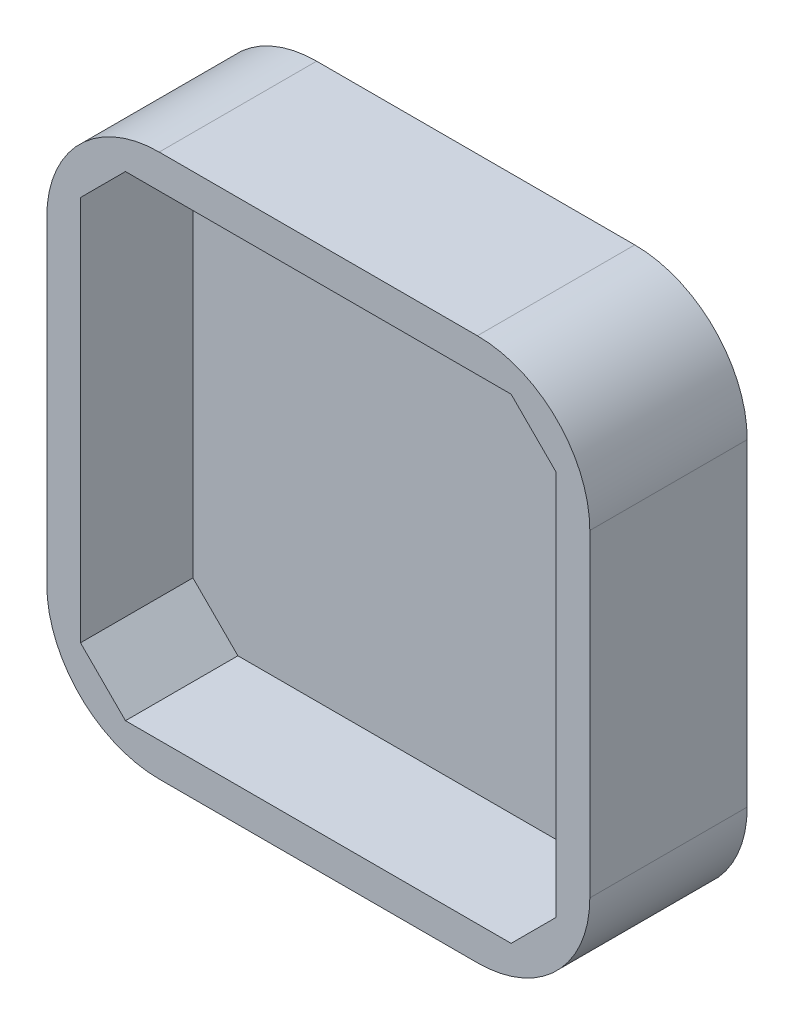
ISO-10303-21;
HEADER;
FILE_DESCRIPTION(('STEP AP214'),'2;1');
FILE_NAME('part.step','',(''),(''),'','','');
FILE_SCHEMA(('AUTOMOTIVE_DESIGN { 1 0 10303 214 1 1 1 1 }'));
ENDSEC;
DATA;
#1=APPLICATION_CONTEXT('core data for automotive mechanical design processes');
#2=APPLICATION_PROTOCOL_DEFINITION('international standard','automotive_design',2000,#1);
#3=PRODUCT_CONTEXT('',#1,'mechanical');
#4=PRODUCT('Part','Part','',(#3));
#5=PRODUCT_RELATED_PRODUCT_CATEGORY('part','',(#4));
#6=PRODUCT_DEFINITION_FORMATION('','',#4);
#7=PRODUCT_DEFINITION_CONTEXT('part definition',#1,'design');
#8=PRODUCT_DEFINITION('design','',#6,#7);
#9=PRODUCT_DEFINITION_SHAPE('','',#8);
#10=(LENGTH_UNIT() NAMED_UNIT(*) SI_UNIT(.MILLI.,.METRE.));
#11=(NAMED_UNIT(*) PLANE_ANGLE_UNIT() SI_UNIT($,.RADIAN.));
#12=(NAMED_UNIT(*) SI_UNIT($,.STERADIAN.) SOLID_ANGLE_UNIT());
#13=UNCERTAINTY_MEASURE_WITH_UNIT(LENGTH_MEASURE(1.E-05),#10,'distance_accuracy_value','');
#14=(GEOMETRIC_REPRESENTATION_CONTEXT(3) GLOBAL_UNCERTAINTY_ASSIGNED_CONTEXT((#13)) GLOBAL_UNIT_ASSIGNED_CONTEXT((#10,
#11,#12)) REPRESENTATION_CONTEXT('',''));
#15=CARTESIAN_POINT('',(0.,0.,0.));
#16=DIRECTION('',(0.,0.,1.));
#17=DIRECTION('',(1.,0.,0.));
#18=AXIS2_PLACEMENT_3D('',#15,#16,#17);
#19=CARTESIAN_POINT('',(-65.5836332326972,0.,17.6139324606775));
#20=DIRECTION('',(-1.,0.,0.));
#21=DIRECTION('',(0.,0.,1.));
#22=AXIS2_PLACEMENT_3D('',#19,#20,#21);
#23=PLANE('',#22);
#24=DIRECTION('',(0.,1.,0.));
#25=VECTOR('',#24,1.);
#26=CARTESIAN_POINT('',(-65.5836332326972,0.,17.6139324606775));
#27=LINE('',#26,#25);
#28=CARTESIAN_POINT('',(-65.5836332326972,-5.70518481580885,17.6139324606775));
#29=VERTEX_POINT('',#28);
#30=CARTESIAN_POINT('',(-65.5836332326972,22.5948151841912,17.6139324606775));
#31=VERTEX_POINT('',#30);
#32=EDGE_CURVE('E233',#29,#31,#27,.T.);
#33=ORIENTED_EDGE('',*,*,#32,.F.);
#34=DIRECTION('',(0.,0.,-1.));
#35=VECTOR('',#34,1.);
#36=CARTESIAN_POINT('',(-65.5836332326972,-5.70518481580885,17.6139324606775));
#37=LINE('',#36,#35);
#38=CARTESIAN_POINT('',(-65.5836332326972,-5.70518481580885,3.61393246067746));
#39=VERTEX_POINT('',#38);
#40=EDGE_CURVE('E11',#29,#39,#37,.T.);
#41=ORIENTED_EDGE('',*,*,#40,.T.);
#42=DIRECTION('',(0.,1.,0.));
#43=VECTOR('',#42,1.);
#44=CARTESIAN_POINT('',(-65.5836332326972,0.,3.61393246067746));
#45=LINE('',#44,#43);
#46=CARTESIAN_POINT('',(-65.5836332326972,22.5948151841912,3.61393246067746));
#47=VERTEX_POINT('',#46);
#48=EDGE_CURVE('E236',#39,#47,#45,.T.);
#49=ORIENTED_EDGE('',*,*,#48,.T.);
#50=DIRECTION('',(0.,0.,-1.));
#51=VECTOR('',#50,1.);
#52=CARTESIAN_POINT('',(-65.5836332326972,22.5948151841912,17.6139324606775));
#53=LINE('',#52,#51);
#54=EDGE_CURVE('E44',#47,#31,#53,.F.);
#55=ORIENTED_EDGE('',*,*,#54,.T.);
#56=EDGE_LOOP('',(#33,#41,#49,#55));
#57=FACE_BOUND('',#56,.T.);
#58=ADVANCED_FACE('F36',(#57),#23,.F.);
#59=CARTESIAN_POINT('',(0.,32.5948151841912,17.6139324606775));
#60=DIRECTION('',(0.,1.,0.));
#61=DIRECTION('',(0.,0.,1.));
#62=AXIS2_PLACEMENT_3D('',#59,#60,#61);
#63=PLANE('',#62);
#64=DIRECTION('',(1.,0.,0.));
#65=VECTOR('',#64,1.);
#66=CARTESIAN_POINT('',(0.,32.5948151841912,3.61393246067746));
#67=LINE('',#66,#65);
#68=CARTESIAN_POINT('',(-103.883633232697,32.5948151841912,3.61393246067746));
#69=VERTEX_POINT('',#68);
#70=CARTESIAN_POINT('',(-75.5836332326972,32.5948151841912,3.61393246067746));
#71=VERTEX_POINT('',#70);
#72=EDGE_CURVE('E164',#69,#71,#67,.T.);
#73=ORIENTED_EDGE('',*,*,#72,.F.);
#74=DIRECTION('',(0.,0.,-1.));
#75=VECTOR('',#74,1.);
#76=CARTESIAN_POINT('',(-103.883633232697,32.5948151841912,17.6139324606775));
#77=LINE('',#76,#75);
#78=CARTESIAN_POINT('',(-103.883633232697,32.5948151841912,17.6139324606775));
#79=VERTEX_POINT('',#78);
#80=EDGE_CURVE('E216',#69,#79,#77,.F.);
#81=ORIENTED_EDGE('',*,*,#80,.T.);
#82=DIRECTION('',(1.,0.,0.));
#83=VECTOR('',#82,1.);
#84=CARTESIAN_POINT('',(0.,32.5948151841912,17.6139324606775));
#85=LINE('',#84,#83);
#86=CARTESIAN_POINT('',(-75.5836332326972,32.5948151841912,17.6139324606775));
#87=VERTEX_POINT('',#86);
#88=EDGE_CURVE('E200',#79,#87,#85,.T.);
#89=ORIENTED_EDGE('',*,*,#88,.T.);
#90=DIRECTION('',(0.,0.,-1.));
#91=VECTOR('',#90,1.);
#92=CARTESIAN_POINT('',(-75.5836332326972,32.5948151841912,3.61393246067746));
#93=LINE('',#92,#91);
#94=EDGE_CURVE('E213',#87,#71,#93,.T.);
#95=ORIENTED_EDGE('',*,*,#94,.T.);
#96=EDGE_LOOP('',(#73,#81,#89,#95));
#97=FACE_BOUND('',#96,.T.);
#98=ADVANCED_FACE('F249',(#97),#63,.T.);
#99=CARTESIAN_POINT('',(-113.883633232697,0.,17.6139324606775));
#100=DIRECTION('',(-1.,0.,0.));
#101=DIRECTION('',(0.,0.,1.));
#102=AXIS2_PLACEMENT_3D('',#99,#100,#101);
#103=PLANE('',#102);
#104=DIRECTION('',(0.,1.,0.));
#105=VECTOR('',#104,1.);
#106=CARTESIAN_POINT('',(-113.883633232697,0.,17.6139324606775));
#107=LINE('',#106,#105);
#108=CARTESIAN_POINT('',(-113.883633232697,-5.70518481580885,17.6139324606775));
#109=VERTEX_POINT('',#108);
#110=CARTESIAN_POINT('',(-113.883633232697,22.5948151841912,17.6139324606775));
#111=VERTEX_POINT('',#110);
#112=EDGE_CURVE('E277',#109,#111,#107,.T.);
#113=ORIENTED_EDGE('',*,*,#112,.T.);
#114=DIRECTION('',(0.,0.,-1.));
#115=VECTOR('',#114,1.);
#116=CARTESIAN_POINT('',(-113.883633232697,22.5948151841912,17.6139324606775));
#117=LINE('',#116,#115);
#118=CARTESIAN_POINT('',(-113.883633232697,22.5948151841912,3.61393246067746));
#119=VERTEX_POINT('',#118);
#120=EDGE_CURVE('E202',#111,#119,#117,.T.);
#121=ORIENTED_EDGE('',*,*,#120,.T.);
#122=DIRECTION('',(0.,1.,0.));
#123=VECTOR('',#122,1.);
#124=CARTESIAN_POINT('',(-113.883633232697,0.,3.61393246067746));
#125=LINE('',#124,#123);
#126=CARTESIAN_POINT('',(-113.883633232697,-5.70518481580885,3.61393246067746));
#127=VERTEX_POINT('',#126);
#128=EDGE_CURVE('E254',#127,#119,#125,.T.);
#129=ORIENTED_EDGE('',*,*,#128,.F.);
#130=DIRECTION('',(0.,0.,-1.));
#131=VECTOR('',#130,1.);
#132=CARTESIAN_POINT('',(-113.883633232697,-5.70518481580885,17.6139324606775));
#133=LINE('',#132,#131);
#134=EDGE_CURVE('E173',#127,#109,#133,.F.);
#135=ORIENTED_EDGE('',*,*,#134,.T.);
#136=EDGE_LOOP('',(#113,#121,#129,#135));
#137=FACE_BOUND('',#136,.T.);
#138=ADVANCED_FACE('F327',(#137),#103,.T.);
#139=CARTESIAN_POINT('',(-21.494409024253,-21.494409024253,17.6139324606775));
#140=DIRECTION('',(0.707106781186547,0.707106781186548,0.));
#141=DIRECTION('',(-0.707106781186548,0.707106781186547,0.));
#142=AXIS2_PLACEMENT_3D('',#139,#140,#141);
#143=PLANE('',#142);
#144=DIRECTION('',(0.707106781186548,-0.707106781186547,0.));
#145=VECTOR('',#144,1.);
#146=CARTESIAN_POINT('',(-21.494409024253,-21.494409024253,7.61393246067746));
#147=LINE('',#146,#145);
#148=CARTESIAN_POINT('',(-72.5836332326972,29.5948151841912,7.61393246067746));
#149=VERTEX_POINT('',#148);
#150=CARTESIAN_POINT('',(-68.5836332326972,25.5948151841912,7.61393246067746));
#151=VERTEX_POINT('',#150);
#152=EDGE_CURVE('E152',#149,#151,#147,.T.);
#153=ORIENTED_EDGE('',*,*,#152,.T.);
#154=DIRECTION('',(0.,0.,-1.));
#155=VECTOR('',#154,1.);
#156=CARTESIAN_POINT('',(-68.5836332326972,25.5948151841912,17.6139324606775));
#157=LINE('',#156,#155);
#158=CARTESIAN_POINT('',(-68.5836332326972,25.5948151841912,17.6139324606775));
#159=VERTEX_POINT('',#158);
#160=EDGE_CURVE('E156',#159,#151,#157,.T.);
#161=ORIENTED_EDGE('',*,*,#160,.F.);
#162=DIRECTION('',(0.707106781186548,-0.707106781186547,0.));
#163=VECTOR('',#162,1.);
#164=CARTESIAN_POINT('',(-21.494409024253,-21.494409024253,17.6139324606775));
#165=LINE('',#164,#163);
#166=CARTESIAN_POINT('',(-72.5836332326972,29.5948151841912,17.6139324606775));
#167=VERTEX_POINT('',#166);
#168=EDGE_CURVE('E180',#167,#159,#165,.T.);
#169=ORIENTED_EDGE('',*,*,#168,.F.);
#170=DIRECTION('',(0.,0.,-1.));
#171=VECTOR('',#170,1.);
#172=CARTESIAN_POINT('',(-72.5836332326972,29.5948151841912,17.6139324606775));
#173=LINE('',#172,#171);
#174=EDGE_CURVE('E159',#167,#149,#173,.T.);
#175=ORIENTED_EDGE('',*,*,#174,.T.);
#176=EDGE_LOOP('',(#153,#161,#169,#175));
#177=FACE_BOUND('',#176,.T.);
#178=ADVANCED_FACE('F154',(#177),#143,.F.);
#179=CARTESIAN_POINT('',(-68.5836332326972,0.,17.6139324606775));
#180=DIRECTION('',(-1.,0.,0.));
#181=DIRECTION('',(0.,0.,1.));
#182=AXIS2_PLACEMENT_3D('',#179,#180,#181);
#183=PLANE('',#182);
#184=DIRECTION('',(0.,1.,0.));
#185=VECTOR('',#184,1.);
#186=CARTESIAN_POINT('',(-68.5836332326972,0.,7.61393246067746));
#187=LINE('',#186,#185);
#188=CARTESIAN_POINT('',(-68.5836332326972,-8.70518481580885,7.61393246067746));
#189=VERTEX_POINT('',#188);
#190=EDGE_CURVE('E169',#189,#151,#187,.T.);
#191=ORIENTED_EDGE('',*,*,#190,.F.);
#192=DIRECTION('',(0.,0.,-1.));
#193=VECTOR('',#192,1.);
#194=CARTESIAN_POINT('',(-68.5836332326972,-8.70518481580885,17.6139324606775));
#195=LINE('',#194,#193);
#196=CARTESIAN_POINT('',(-68.5836332326972,-8.70518481580885,17.6139324606775));
#197=VERTEX_POINT('',#196);
#198=EDGE_CURVE('E174',#197,#189,#195,.T.);
#199=ORIENTED_EDGE('',*,*,#198,.F.);
#200=DIRECTION('',(0.,1.,0.));
#201=VECTOR('',#200,1.);
#202=CARTESIAN_POINT('',(-68.5836332326972,0.,17.6139324606775));
#203=LINE('',#202,#201);
#204=EDGE_CURVE('E172',#197,#159,#203,.T.);
#205=ORIENTED_EDGE('',*,*,#204,.T.);
#206=ORIENTED_EDGE('',*,*,#160,.T.);
#207=EDGE_LOOP('',(#191,#199,#205,#206));
#208=FACE_BOUND('',#207,.T.);
#209=ADVANCED_FACE('F168',(#208),#183,.T.);
#210=CARTESIAN_POINT('',(-29.9392242084443,29.9392242084442,17.6139324606775));
#211=DIRECTION('',(-0.707106781186548,0.707106781186547,0.));
#212=DIRECTION('',(-0.707106781186547,-0.707106781186548,0.));
#213=AXIS2_PLACEMENT_3D('',#210,#211,#212);
#214=PLANE('',#213);
#215=DIRECTION('',(0.707106781186547,0.707106781186548,0.));
#216=VECTOR('',#215,1.);
#217=CARTESIAN_POINT('',(-29.9392242084443,29.9392242084442,7.61393246067746));
#218=LINE('',#217,#216);
#219=CARTESIAN_POINT('',(-72.5836332326972,-12.7051848158088,7.61393246067746));
#220=VERTEX_POINT('',#219);
#221=EDGE_CURVE('E179',#220,#189,#218,.T.);
#222=ORIENTED_EDGE('',*,*,#221,.F.);
#223=DIRECTION('',(0.,0.,-1.));
#224=VECTOR('',#223,1.);
#225=CARTESIAN_POINT('',(-72.5836332326972,-12.7051848158088,17.6139324606775));
#226=LINE('',#225,#224);
#227=CARTESIAN_POINT('',(-72.5836332326972,-12.7051848158088,17.6139324606775));
#228=VERTEX_POINT('',#227);
#229=EDGE_CURVE('E189',#228,#220,#226,.T.);
#230=ORIENTED_EDGE('',*,*,#229,.F.);
#231=DIRECTION('',(0.707106781186547,0.707106781186548,0.));
#232=VECTOR('',#231,1.);
#233=CARTESIAN_POINT('',(-29.9392242084443,29.9392242084442,17.6139324606775));
#234=LINE('',#233,#232);
#235=EDGE_CURVE('E272',#228,#197,#234,.T.);
#236=ORIENTED_EDGE('',*,*,#235,.T.);
#237=ORIENTED_EDGE('',*,*,#198,.T.);
#238=EDGE_LOOP('',(#222,#230,#236,#237));
#239=FACE_BOUND('',#238,.T.);
#240=ADVANCED_FACE('F298',(#239),#214,.T.);
#241=CARTESIAN_POINT('',(0.,-12.7051848158088,17.6139324606775));
#242=DIRECTION('',(0.,1.,0.));
#243=DIRECTION('',(-1.,0.,0.));
#244=AXIS2_PLACEMENT_3D('',#241,#242,#243);
#245=PLANE('',#244);
#246=DIRECTION('',(1.,0.,0.));
#247=VECTOR('',#246,1.);
#248=CARTESIAN_POINT('',(0.,-12.7051848158088,7.61393246067746));
#249=LINE('',#248,#247);
#250=CARTESIAN_POINT('',(-106.883633232697,-12.7051848158089,7.61393246067746));
#251=VERTEX_POINT('',#250);
#252=EDGE_CURVE('E184',#251,#220,#249,.T.);
#253=ORIENTED_EDGE('',*,*,#252,.F.);
#254=DIRECTION('',(0.,0.,-1.));
#255=VECTOR('',#254,1.);
#256=CARTESIAN_POINT('',(-106.883633232697,-12.7051848158089,17.6139324606775));
#257=LINE('',#256,#255);
#258=CARTESIAN_POINT('',(-106.883633232697,-12.7051848158089,17.6139324606775));
#259=VERTEX_POINT('',#258);
#260=EDGE_CURVE('E191',#259,#251,#257,.T.);
#261=ORIENTED_EDGE('',*,*,#260,.F.);
#262=DIRECTION('',(1.,0.,0.));
#263=VECTOR('',#262,1.);
#264=CARTESIAN_POINT('',(0.,-12.7051848158088,17.6139324606775));
#265=LINE('',#264,#263);
#266=EDGE_CURVE('E269',#259,#228,#265,.T.);
#267=ORIENTED_EDGE('',*,*,#266,.T.);
#268=ORIENTED_EDGE('',*,*,#229,.T.);
#269=EDGE_LOOP('',(#253,#261,#267,#268));
#270=FACE_BOUND('',#269,.T.);
#271=ADVANCED_FACE('F294',(#270),#245,.T.);
#272=CARTESIAN_POINT('',(-59.7944090242532,-59.794409024253,17.6139324606775));
#273=DIRECTION('',(0.707106781186548,0.707106781186547,0.));
#274=DIRECTION('',(-0.707106781186547,0.707106781186548,0.));
#275=AXIS2_PLACEMENT_3D('',#272,#273,#274);
#276=PLANE('',#275);
#277=DIRECTION('',(0.707106781186547,-0.707106781186548,0.));
#278=VECTOR('',#277,1.);
#279=CARTESIAN_POINT('',(-59.7944090242532,-59.794409024253,7.61393246067746));
#280=LINE('',#279,#278);
#281=CARTESIAN_POINT('',(-110.883633232697,-8.70518481580885,7.61393246067746));
#282=VERTEX_POINT('',#281);
#283=EDGE_CURVE('E288',#282,#251,#280,.T.);
#284=ORIENTED_EDGE('',*,*,#283,.F.);
#285=DIRECTION('',(0.,0.,-1.));
#286=VECTOR('',#285,1.);
#287=CARTESIAN_POINT('',(-110.883633232697,-8.70518481580885,17.6139324606775));
#288=LINE('',#287,#286);
#289=CARTESIAN_POINT('',(-110.883633232697,-8.70518481580885,17.6139324606775));
#290=VERTEX_POINT('',#289);
#291=EDGE_CURVE('E193',#290,#282,#288,.T.);
#292=ORIENTED_EDGE('',*,*,#291,.F.);
#293=DIRECTION('',(0.707106781186547,-0.707106781186548,0.));
#294=VECTOR('',#293,1.);
#295=CARTESIAN_POINT('',(-59.7944090242532,-59.794409024253,17.6139324606775));
#296=LINE('',#295,#294);
#297=EDGE_CURVE('E266',#290,#259,#296,.T.);
#298=ORIENTED_EDGE('',*,*,#297,.T.);
#299=ORIENTED_EDGE('',*,*,#260,.T.);
#300=EDGE_LOOP('',(#284,#292,#298,#299));
#301=FACE_BOUND('',#300,.T.);
#302=ADVANCED_FACE('F313',(#301),#276,.T.);
#303=CARTESIAN_POINT('',(-110.883633232697,0.,17.6139324606775));
#304=DIRECTION('',(-1.,0.,0.));
#305=DIRECTION('',(0.,-1.,0.));
#306=AXIS2_PLACEMENT_3D('',#303,#304,#305);
#307=PLANE('',#306);
#308=DIRECTION('',(0.,1.,0.));
#309=VECTOR('',#308,1.);
#310=CARTESIAN_POINT('',(-110.883633232697,0.,7.61393246067746));
#311=LINE('',#310,#309);
#312=CARTESIAN_POINT('',(-110.883633232697,25.5948151841912,7.61393246067746));
#313=VERTEX_POINT('',#312);
#314=EDGE_CURVE('E285',#282,#313,#311,.T.);
#315=ORIENTED_EDGE('',*,*,#314,.T.);
#316=DIRECTION('',(0.,0.,-1.));
#317=VECTOR('',#316,1.);
#318=CARTESIAN_POINT('',(-110.883633232697,25.5948151841912,17.6139324606775));
#319=LINE('',#318,#317);
#320=CARTESIAN_POINT('',(-110.883633232697,25.5948151841912,17.6139324606775));
#321=VERTEX_POINT('',#320);
#322=EDGE_CURVE('E195',#321,#313,#319,.T.);
#323=ORIENTED_EDGE('',*,*,#322,.F.);
#324=DIRECTION('',(0.,1.,0.));
#325=VECTOR('',#324,1.);
#326=CARTESIAN_POINT('',(-110.883633232697,0.,17.6139324606775));
#327=LINE('',#326,#325);
#328=EDGE_CURVE('E264',#290,#321,#327,.T.);
#329=ORIENTED_EDGE('',*,*,#328,.F.);
#330=ORIENTED_EDGE('',*,*,#291,.T.);
#331=EDGE_LOOP('',(#315,#323,#329,#330));
#332=FACE_BOUND('',#331,.T.);
#333=ADVANCED_FACE('F310',(#332),#307,.F.);
#334=CARTESIAN_POINT('',(-68.2392242084442,68.2392242084442,17.6139324606775));
#335=DIRECTION('',(0.707106781186547,-0.707106781186548,0.));
#336=DIRECTION('',(0.707106781186548,0.707106781186547,0.));
#337=AXIS2_PLACEMENT_3D('',#334,#335,#336);
#338=PLANE('',#337);
#339=DIRECTION('',(-0.707106781186548,-0.707106781186547,0.));
#340=VECTOR('',#339,1.);
#341=CARTESIAN_POINT('',(-68.2392242084442,68.2392242084442,7.61393246067746));
#342=LINE('',#341,#340);
#343=CARTESIAN_POINT('',(-106.883633232697,29.5948151841912,7.61393246067746));
#344=VERTEX_POINT('',#343);
#345=EDGE_CURVE('E282',#344,#313,#342,.T.);
#346=ORIENTED_EDGE('',*,*,#345,.F.);
#347=DIRECTION('',(0.,0.,-1.));
#348=VECTOR('',#347,1.);
#349=CARTESIAN_POINT('',(-106.883633232697,29.5948151841912,17.6139324606775));
#350=LINE('',#349,#348);
#351=CARTESIAN_POINT('',(-106.883633232697,29.5948151841912,17.6139324606775));
#352=VERTEX_POINT('',#351);
#353=EDGE_CURVE('E197',#352,#344,#350,.T.);
#354=ORIENTED_EDGE('',*,*,#353,.F.);
#355=DIRECTION('',(-0.707106781186548,-0.707106781186547,0.));
#356=VECTOR('',#355,1.);
#357=CARTESIAN_POINT('',(-68.2392242084442,68.2392242084442,17.6139324606775));
#358=LINE('',#357,#356);
#359=EDGE_CURVE('E261',#352,#321,#358,.T.);
#360=ORIENTED_EDGE('',*,*,#359,.T.);
#361=ORIENTED_EDGE('',*,*,#322,.T.);
#362=EDGE_LOOP('',(#346,#354,#360,#361));
#363=FACE_BOUND('',#362,.T.);
#364=ADVANCED_FACE('F306',(#363),#338,.T.);
#365=CARTESIAN_POINT('',(0.,29.5948151841912,17.6139324606775));
#366=DIRECTION('',(0.,1.,0.));
#367=DIRECTION('',(0.,0.,1.));
#368=AXIS2_PLACEMENT_3D('',#365,#366,#367);
#369=PLANE('',#368);
#370=DIRECTION('',(1.,0.,0.));
#371=VECTOR('',#370,1.);
#372=CARTESIAN_POINT('',(0.,29.5948151841912,7.61393246067746));
#373=LINE('',#372,#371);
#374=EDGE_CURVE('E163',#344,#149,#373,.T.);
#375=ORIENTED_EDGE('',*,*,#374,.T.);
#376=ORIENTED_EDGE('',*,*,#174,.F.);
#377=DIRECTION('',(1.,0.,0.));
#378=VECTOR('',#377,1.);
#379=CARTESIAN_POINT('',(0.,29.5948151841912,17.6139324606775));
#380=LINE('',#379,#378);
#381=EDGE_CURVE('E182',#352,#167,#380,.T.);
#382=ORIENTED_EDGE('',*,*,#381,.F.);
#383=ORIENTED_EDGE('',*,*,#353,.T.);
#384=EDGE_LOOP('',(#375,#376,#382,#383));
#385=FACE_BOUND('',#384,.T.);
#386=ADVANCED_FACE('F303',(#385),#369,.F.);
#387=CARTESIAN_POINT('',(0.,-15.7051848158089,17.6139324606775));
#388=DIRECTION('',(0.,1.,0.));
#389=DIRECTION('',(0.,0.,1.));
#390=AXIS2_PLACEMENT_3D('',#387,#388,#389);
#391=PLANE('',#390);
#392=DIRECTION('',(1.,0.,0.));
#393=VECTOR('',#392,1.);
#394=CARTESIAN_POINT('',(0.,-15.7051848158089,17.6139324606775));
#395=LINE('',#394,#393);
#396=CARTESIAN_POINT('',(-103.883633232697,-15.7051848158089,17.6139324606775));
#397=VERTEX_POINT('',#396);
#398=CARTESIAN_POINT('',(-75.5836332326972,-15.7051848158089,17.6139324606775));
#399=VERTEX_POINT('',#398);
#400=EDGE_CURVE('E243',#397,#399,#395,.T.);
#401=ORIENTED_EDGE('',*,*,#400,.F.);
#402=DIRECTION('',(0.,0.,-1.));
#403=VECTOR('',#402,1.);
#404=CARTESIAN_POINT('',(-103.883633232697,-15.7051848158089,3.61393246067746));
#405=LINE('',#404,#403);
#406=CARTESIAN_POINT('',(-103.883633232697,-15.7051848158089,3.61393246067746));
#407=VERTEX_POINT('',#406);
#408=EDGE_CURVE('E226',#397,#407,#405,.T.);
#409=ORIENTED_EDGE('',*,*,#408,.T.);
#410=DIRECTION('',(1.,0.,0.));
#411=VECTOR('',#410,1.);
#412=CARTESIAN_POINT('',(0.,-15.7051848158089,3.61393246067746));
#413=LINE('',#412,#411);
#414=CARTESIAN_POINT('',(-75.5836332326972,-15.7051848158089,3.61393246067746));
#415=VERTEX_POINT('',#414);
#416=EDGE_CURVE('E256',#407,#415,#413,.T.);
#417=ORIENTED_EDGE('',*,*,#416,.T.);
#418=DIRECTION('',(0.,0.,-1.));
#419=VECTOR('',#418,1.);
#420=CARTESIAN_POINT('',(-75.5836332326972,-15.7051848158089,17.6139324606775));
#421=LINE('',#420,#419);
#422=EDGE_CURVE('E51',#415,#399,#421,.F.);
#423=ORIENTED_EDGE('',*,*,#422,.T.);
#424=EDGE_LOOP('',(#401,#409,#417,#423));
#425=FACE_BOUND('',#424,.T.);
#426=ADVANCED_FACE('F331',(#425),#391,.F.);
#427=CARTESIAN_POINT('',(0.,0.,17.6139324606775));
#428=DIRECTION('',(0.,0.,-1.));
#429=DIRECTION('',(-1.,0.,0.));
#430=AXIS2_PLACEMENT_3D('',#427,#428,#429);
#431=PLANE('',#430);
#432=ORIENTED_EDGE('',*,*,#168,.T.);
#433=ORIENTED_EDGE('',*,*,#204,.F.);
#434=ORIENTED_EDGE('',*,*,#235,.F.);
#435=ORIENTED_EDGE('',*,*,#266,.F.);
#436=ORIENTED_EDGE('',*,*,#297,.F.);
#437=ORIENTED_EDGE('',*,*,#328,.T.);
#438=ORIENTED_EDGE('',*,*,#359,.F.);
#439=ORIENTED_EDGE('',*,*,#381,.T.);
#440=EDGE_LOOP('',(#432,#433,#434,#435,#436,#437,#438,#439));
#441=FACE_BOUND('',#440,.T.);
#442=ORIENTED_EDGE('',*,*,#88,.F.);
#443=CARTESIAN_POINT('',(-103.883633232697,22.5948151841912,17.6139324606775));
#444=DIRECTION('',(0.,0.,-1.));
#445=DIRECTION('',(-1.,0.,0.));
#446=AXIS2_PLACEMENT_3D('',#443,#444,#445);
#447=CIRCLE('',#446,10.);
#448=EDGE_CURVE('E223',#79,#111,#447,.F.);
#449=ORIENTED_EDGE('',*,*,#448,.T.);
#450=ORIENTED_EDGE('',*,*,#112,.F.);
#451=CARTESIAN_POINT('',(-103.883633232697,-5.70518481580885,17.6139324606775));
#452=DIRECTION('',(0.,0.,-1.));
#453=DIRECTION('',(-1.,0.,0.));
#454=AXIS2_PLACEMENT_3D('',#451,#452,#453);
#455=CIRCLE('',#454,10.);
#456=EDGE_CURVE('E58',#109,#397,#455,.F.);
#457=ORIENTED_EDGE('',*,*,#456,.T.);
#458=ORIENTED_EDGE('',*,*,#400,.T.);
#459=CARTESIAN_POINT('',(-75.5836332326972,-5.70518481580885,17.6139324606775));
#460=DIRECTION('',(0.,0.,-1.));
#461=DIRECTION('',(-1.,0.,0.));
#462=AXIS2_PLACEMENT_3D('',#459,#460,#461);
#463=CIRCLE('',#462,10.);
#464=EDGE_CURVE('E220',#399,#29,#463,.F.);
#465=ORIENTED_EDGE('',*,*,#464,.T.);
#466=ORIENTED_EDGE('',*,*,#32,.T.);
#467=CARTESIAN_POINT('',(-75.5836332326972,22.5948151841912,17.6139324606775));
#468=DIRECTION('',(0.,0.,-1.));
#469=DIRECTION('',(-1.,0.,0.));
#470=AXIS2_PLACEMENT_3D('',#467,#468,#469);
#471=CIRCLE('',#470,10.);
#472=EDGE_CURVE('E218',#31,#87,#471,.F.);
#473=ORIENTED_EDGE('',*,*,#472,.T.);
#474=EDGE_LOOP('',(#442,#449,#450,#457,#458,#465,#466,#473));
#475=FACE_BOUND('',#474,.T.);
#476=ADVANCED_FACE('F240',(#441,#475),#431,.F.);
#477=CARTESIAN_POINT('',(0.,0.,7.61393246067746));
#478=DIRECTION('',(0.,0.,-1.));
#479=DIRECTION('',(-1.,0.,0.));
#480=AXIS2_PLACEMENT_3D('',#477,#478,#479);
#481=PLANE('',#480);
#482=ORIENTED_EDGE('',*,*,#152,.F.);
#483=ORIENTED_EDGE('',*,*,#374,.F.);
#484=ORIENTED_EDGE('',*,*,#345,.T.);
#485=ORIENTED_EDGE('',*,*,#314,.F.);
#486=ORIENTED_EDGE('',*,*,#283,.T.);
#487=ORIENTED_EDGE('',*,*,#252,.T.);
#488=ORIENTED_EDGE('',*,*,#221,.T.);
#489=ORIENTED_EDGE('',*,*,#190,.T.);
#490=EDGE_LOOP('',(#482,#483,#484,#485,#486,#487,#488,#489));
#491=FACE_BOUND('',#490,.T.);
#492=ADVANCED_FACE('F176',(#491),#481,.F.);
#493=CARTESIAN_POINT('',(0.,0.,3.61393246067746));
#494=DIRECTION('',(0.,0.,-1.));
#495=DIRECTION('',(-1.,0.,0.));
#496=AXIS2_PLACEMENT_3D('',#493,#494,#495);
#497=PLANE('',#496);
#498=CARTESIAN_POINT('',(-74.2336332326972,23.9448151841912,3.61393246067746));
#499=DIRECTION('',(0.,0.,-1.));
#500=DIRECTION('',(-1.,0.,0.));
#501=AXIS2_PLACEMENT_3D('',#498,#499,#500);
#502=CIRCLE('',#501,1.5);
#503=CARTESIAN_POINT('',(-75.7336332326972,23.9448151841912,3.61393246067746));
#504=VERTEX_POINT('',#503);
#505=EDGE_CURVE('E574',#504,#504,#502,.T.);
#506=ORIENTED_EDGE('',*,*,#505,.F.);
#507=EDGE_LOOP('',(#506));
#508=FACE_BOUND('',#507,.T.);
#509=CARTESIAN_POINT('',(-74.2336332326981,-7.05518481580885,3.61393246067746));
#510=DIRECTION('',(0.,0.,-1.));
#511=DIRECTION('',(-1.,0.,0.));
#512=AXIS2_PLACEMENT_3D('',#509,#510,#511);
#513=CIRCLE('',#512,1.5);
#514=CARTESIAN_POINT('',(-75.7336332326981,-7.05518481580885,3.61393246067746));
#515=VERTEX_POINT('',#514);
#516=EDGE_CURVE('E580',#515,#515,#513,.T.);
#517=ORIENTED_EDGE('',*,*,#516,.F.);
#518=EDGE_LOOP('',(#517));
#519=FACE_BOUND('',#518,.T.);
#520=CARTESIAN_POINT('',(-105.233633232698,-7.05518481580797,3.61393246067746));
#521=DIRECTION('',(0.,0.,-1.));
#522=DIRECTION('',(-1.,0.,0.));
#523=AXIS2_PLACEMENT_3D('',#520,#521,#522);
#524=CIRCLE('',#523,1.5);
#525=CARTESIAN_POINT('',(-106.733633232698,-7.05518481580797,3.61393246067746));
#526=VERTEX_POINT('',#525);
#527=EDGE_CURVE('E586',#526,#526,#524,.T.);
#528=ORIENTED_EDGE('',*,*,#527,.F.);
#529=EDGE_LOOP('',(#528));
#530=FACE_BOUND('',#529,.T.);
#531=CARTESIAN_POINT('',(-105.233633232697,23.944815184192,3.61393246067746));
#532=DIRECTION('',(0.,0.,-1.));
#533=DIRECTION('',(-1.,0.,0.));
#534=AXIS2_PLACEMENT_3D('',#531,#532,#533);
#535=CIRCLE('',#534,1.5);
#536=CARTESIAN_POINT('',(-106.733633232697,23.944815184192,3.61393246067746));
#537=VERTEX_POINT('',#536);
#538=EDGE_CURVE('E568',#537,#537,#535,.T.);
#539=ORIENTED_EDGE('',*,*,#538,.F.);
#540=EDGE_LOOP('',(#539));
#541=FACE_BOUND('',#540,.T.);
#542=ORIENTED_EDGE('',*,*,#128,.T.);
#543=CARTESIAN_POINT('',(-103.883633232697,22.5948151841912,3.61393246067746));
#544=DIRECTION('',(0.,0.,-1.));
#545=DIRECTION('',(-1.,0.,0.));
#546=AXIS2_PLACEMENT_3D('',#543,#544,#545);
#547=CIRCLE('',#546,10.);
#548=EDGE_CURVE('E211',#119,#69,#547,.T.);
#549=ORIENTED_EDGE('',*,*,#548,.T.);
#550=ORIENTED_EDGE('',*,*,#72,.T.);
#551=CARTESIAN_POINT('',(-75.5836332326972,22.5948151841912,3.61393246067746));
#552=DIRECTION('',(0.,0.,-1.));
#553=DIRECTION('',(-1.,0.,0.));
#554=AXIS2_PLACEMENT_3D('',#551,#552,#553);
#555=CIRCLE('',#554,10.);
#556=EDGE_CURVE('E205',#71,#47,#555,.T.);
#557=ORIENTED_EDGE('',*,*,#556,.T.);
#558=ORIENTED_EDGE('',*,*,#48,.F.);
#559=CARTESIAN_POINT('',(-75.5836332326972,-5.70518481580885,3.61393246067746));
#560=DIRECTION('',(0.,0.,-1.));
#561=DIRECTION('',(-1.,0.,0.));
#562=AXIS2_PLACEMENT_3D('',#559,#560,#561);
#563=CIRCLE('',#562,10.);
#564=EDGE_CURVE('E207',#39,#415,#563,.T.);
#565=ORIENTED_EDGE('',*,*,#564,.T.);
#566=ORIENTED_EDGE('',*,*,#416,.F.);
#567=CARTESIAN_POINT('',(-103.883633232697,-5.70518481580885,3.61393246067746));
#568=DIRECTION('',(0.,0.,-1.));
#569=DIRECTION('',(-1.,0.,0.));
#570=AXIS2_PLACEMENT_3D('',#567,#568,#569);
#571=CIRCLE('',#570,10.);
#572=EDGE_CURVE('E209',#407,#127,#571,.T.);
#573=ORIENTED_EDGE('',*,*,#572,.T.);
#574=EDGE_LOOP('',(#542,#549,#550,#557,#558,#565,#566,#573));
#575=FACE_BOUND('',#574,.T.);
#576=ADVANCED_FACE('F253',(#508,#519,#530,#541,#575),#497,.T.);
#577=CARTESIAN_POINT('',(-105.233633232697,23.944815184192,7.11393246067746));
#578=DIRECTION('',(0.,0.,-1.));
#579=DIRECTION('',(-1.,0.,0.));
#580=AXIS2_PLACEMENT_3D('',#577,#578,#579);
#581=CYLINDRICAL_SURFACE('',#580,1.5);
#582=CARTESIAN_POINT('',(-105.233633232697,23.944815184192,7.11393246067746));
#583=DIRECTION('',(0.,0.,-1.));
#584=DIRECTION('',(-1.,0.,0.));
#585=AXIS2_PLACEMENT_3D('',#582,#583,#584);
#586=CIRCLE('',#585,1.5);
#587=CARTESIAN_POINT('',(-106.733633232697,23.944815184192,7.11393246067746));
#588=VERTEX_POINT('',#587);
#589=EDGE_CURVE('E565',#588,#588,#586,.T.);
#590=ORIENTED_EDGE('',*,*,#589,.F.);
#591=EDGE_LOOP('',(#590));
#592=FACE_BOUND('',#591,.T.);
#593=ORIENTED_EDGE('',*,*,#538,.T.);
#594=EDGE_LOOP('',(#593));
#595=FACE_BOUND('',#594,.T.);
#596=ADVANCED_FACE('F390',(#592,#595),#581,.F.);
#597=CARTESIAN_POINT('',(-105.233633232697,23.944815184192,7.11393246067746));
#598=DIRECTION('',(0.,0.,-1.));
#599=DIRECTION('',(-1.,0.,0.));
#600=AXIS2_PLACEMENT_3D('',#597,#598,#599);
#601=PLANE('',#600);
#602=ORIENTED_EDGE('',*,*,#589,.T.);
#603=EDGE_LOOP('',(#602));
#604=FACE_BOUND('',#603,.T.);
#605=ADVANCED_FACE('F395',(#604),#601,.T.);
#606=CARTESIAN_POINT('',(-105.233633232698,-7.05518481580797,7.11393246067746));
#607=DIRECTION('',(0.,0.,-1.));
#608=DIRECTION('',(-1.,0.,0.));
#609=AXIS2_PLACEMENT_3D('',#606,#607,#608);
#610=CYLINDRICAL_SURFACE('',#609,1.5);
#611=CARTESIAN_POINT('',(-105.233633232698,-7.05518481580797,7.11393246067746));
#612=DIRECTION('',(0.,0.,-1.));
#613=DIRECTION('',(-1.,0.,0.));
#614=AXIS2_PLACEMENT_3D('',#611,#612,#613);
#615=CIRCLE('',#614,1.5);
#616=CARTESIAN_POINT('',(-106.733633232698,-7.05518481580797,7.11393246067746));
#617=VERTEX_POINT('',#616);
#618=EDGE_CURVE('E572',#617,#617,#615,.T.);
#619=ORIENTED_EDGE('',*,*,#618,.F.);
#620=EDGE_LOOP('',(#619));
#621=FACE_BOUND('',#620,.T.);
#622=ORIENTED_EDGE('',*,*,#527,.T.);
#623=EDGE_LOOP('',(#622));
#624=FACE_BOUND('',#623,.T.);
#625=ADVANCED_FACE('F405',(#621,#624),#610,.F.);
#626=CARTESIAN_POINT('',(-105.233633232698,-7.05518481580797,7.11393246067746));
#627=DIRECTION('',(0.,0.,-1.));
#628=DIRECTION('',(-1.,0.,0.));
#629=AXIS2_PLACEMENT_3D('',#626,#627,#628);
#630=PLANE('',#629);
#631=ORIENTED_EDGE('',*,*,#618,.T.);
#632=EDGE_LOOP('',(#631));
#633=FACE_BOUND('',#632,.T.);
#634=ADVANCED_FACE('F415',(#633),#630,.T.);
#635=CARTESIAN_POINT('',(-74.2336332326981,-7.05518481580885,7.11393246067746));
#636=DIRECTION('',(0.,0.,-1.));
#637=DIRECTION('',(-1.,0.,0.));
#638=AXIS2_PLACEMENT_3D('',#635,#636,#637);
#639=CYLINDRICAL_SURFACE('',#638,1.5);
#640=CARTESIAN_POINT('',(-74.2336332326981,-7.05518481580885,7.11393246067746));
#641=DIRECTION('',(0.,0.,-1.));
#642=DIRECTION('',(-1.,0.,0.));
#643=AXIS2_PLACEMENT_3D('',#640,#641,#642);
#644=CIRCLE('',#643,1.5);
#645=CARTESIAN_POINT('',(-75.7336332326981,-7.05518481580885,7.11393246067746));
#646=VERTEX_POINT('',#645);
#647=EDGE_CURVE('E583',#646,#646,#644,.T.);
#648=ORIENTED_EDGE('',*,*,#647,.F.);
#649=EDGE_LOOP('',(#648));
#650=FACE_BOUND('',#649,.T.);
#651=ORIENTED_EDGE('',*,*,#516,.T.);
#652=EDGE_LOOP('',(#651));
#653=FACE_BOUND('',#652,.T.);
#654=ADVANCED_FACE('F425',(#650,#653),#639,.F.);
#655=CARTESIAN_POINT('',(-74.2336332326981,-7.05518481580885,7.11393246067746));
#656=DIRECTION('',(0.,0.,-1.));
#657=DIRECTION('',(-1.,0.,0.));
#658=AXIS2_PLACEMENT_3D('',#655,#656,#657);
#659=PLANE('',#658);
#660=ORIENTED_EDGE('',*,*,#647,.T.);
#661=EDGE_LOOP('',(#660));
#662=FACE_BOUND('',#661,.T.);
#663=ADVANCED_FACE('F435',(#662),#659,.T.);
#664=CARTESIAN_POINT('',(-74.2336332326972,23.9448151841912,7.11393246067746));
#665=DIRECTION('',(0.,0.,-1.));
#666=DIRECTION('',(-1.,0.,0.));
#667=AXIS2_PLACEMENT_3D('',#664,#665,#666);
#668=CYLINDRICAL_SURFACE('',#667,1.5);
#669=CARTESIAN_POINT('',(-74.2336332326972,23.9448151841912,7.11393246067746));
#670=DIRECTION('',(0.,0.,-1.));
#671=DIRECTION('',(-1.,0.,0.));
#672=AXIS2_PLACEMENT_3D('',#669,#670,#671);
#673=CIRCLE('',#672,1.5);
#674=CARTESIAN_POINT('',(-75.7336332326972,23.9448151841912,7.11393246067746));
#675=VERTEX_POINT('',#674);
#676=EDGE_CURVE('E577',#675,#675,#673,.T.);
#677=ORIENTED_EDGE('',*,*,#676,.F.);
#678=EDGE_LOOP('',(#677));
#679=FACE_BOUND('',#678,.T.);
#680=ORIENTED_EDGE('',*,*,#505,.T.);
#681=EDGE_LOOP('',(#680));
#682=FACE_BOUND('',#681,.T.);
#683=ADVANCED_FACE('F445',(#679,#682),#668,.F.);
#684=CARTESIAN_POINT('',(-74.2336332326972,23.9448151841912,7.11393246067746));
#685=DIRECTION('',(0.,0.,-1.));
#686=DIRECTION('',(-1.,0.,0.));
#687=AXIS2_PLACEMENT_3D('',#684,#685,#686);
#688=PLANE('',#687);
#689=ORIENTED_EDGE('',*,*,#676,.T.);
#690=EDGE_LOOP('',(#689));
#691=FACE_BOUND('',#690,.T.);
#692=ADVANCED_FACE('F455',(#691),#688,.T.);
#693=CARTESIAN_POINT('',(-103.883633232697,22.5948151841912,17.6139324606775));
#694=DIRECTION('',(0.,0.,-1.));
#695=DIRECTION('',(-1.,0.,0.));
#696=AXIS2_PLACEMENT_3D('',#693,#694,#695);
#697=CYLINDRICAL_SURFACE('',#696,10.);
#698=ORIENTED_EDGE('',*,*,#448,.F.);
#699=ORIENTED_EDGE('',*,*,#80,.F.);
#700=ORIENTED_EDGE('',*,*,#548,.F.);
#701=ORIENTED_EDGE('',*,*,#120,.F.);
#702=EDGE_LOOP('',(#698,#699,#700,#701));
#703=FACE_BOUND('',#702,.T.);
#704=ADVANCED_FACE('F464',(#703),#697,.T.);
#705=CARTESIAN_POINT('',(-103.883633232697,-5.70518481580885,17.6139324606775));
#706=DIRECTION('',(0.,0.,1.));
#707=DIRECTION('',(1.,0.,0.));
#708=AXIS2_PLACEMENT_3D('',#705,#706,#707);
#709=CYLINDRICAL_SURFACE('',#708,10.);
#710=ORIENTED_EDGE('',*,*,#456,.F.);
#711=ORIENTED_EDGE('',*,*,#134,.F.);
#712=ORIENTED_EDGE('',*,*,#572,.F.);
#713=ORIENTED_EDGE('',*,*,#408,.F.);
#714=EDGE_LOOP('',(#710,#711,#712,#713));
#715=FACE_BOUND('',#714,.T.);
#716=ADVANCED_FACE('F515',(#715),#709,.T.);
#717=CARTESIAN_POINT('',(-75.5836332326972,-5.70518481580885,17.6139324606775));
#718=DIRECTION('',(0.,0.,-1.));
#719=DIRECTION('',(-1.,0.,0.));
#720=AXIS2_PLACEMENT_3D('',#717,#718,#719);
#721=CYLINDRICAL_SURFACE('',#720,10.);
#722=ORIENTED_EDGE('',*,*,#464,.F.);
#723=ORIENTED_EDGE('',*,*,#422,.F.);
#724=ORIENTED_EDGE('',*,*,#564,.F.);
#725=ORIENTED_EDGE('',*,*,#40,.F.);
#726=EDGE_LOOP('',(#722,#723,#724,#725));
#727=FACE_BOUND('',#726,.T.);
#728=ADVANCED_FACE('F525',(#727),#721,.T.);
#729=CARTESIAN_POINT('',(-75.5836332326972,22.5948151841912,17.6139324606775));
#730=DIRECTION('',(0.,0.,1.));
#731=DIRECTION('',(1.,0.,0.));
#732=AXIS2_PLACEMENT_3D('',#729,#730,#731);
#733=CYLINDRICAL_SURFACE('',#732,10.);
#734=ORIENTED_EDGE('',*,*,#472,.F.);
#735=ORIENTED_EDGE('',*,*,#54,.F.);
#736=ORIENTED_EDGE('',*,*,#556,.F.);
#737=ORIENTED_EDGE('',*,*,#94,.F.);
#738=EDGE_LOOP('',(#734,#735,#736,#737));
#739=FACE_BOUND('',#738,.T.);
#740=ADVANCED_FACE('F38',(#739),#733,.T.);
#741=CLOSED_SHELL('',(#58,#98,#138,#178,#209,#240,#271,#302,#333,#364,#386,#426,#476,#492,#576,
#596,#605,#625,#634,#654,#663,#683,#692,#704,#716,#728,#740));
#742=MANIFOLD_SOLID_BREP('B2',#741);
#743=ADVANCED_BREP_SHAPE_REPRESENTATION('',(#18,#742),#14);
#744=SHAPE_DEFINITION_REPRESENTATION(#9,#743);
ENDSEC;
END-ISO-10303-21;
